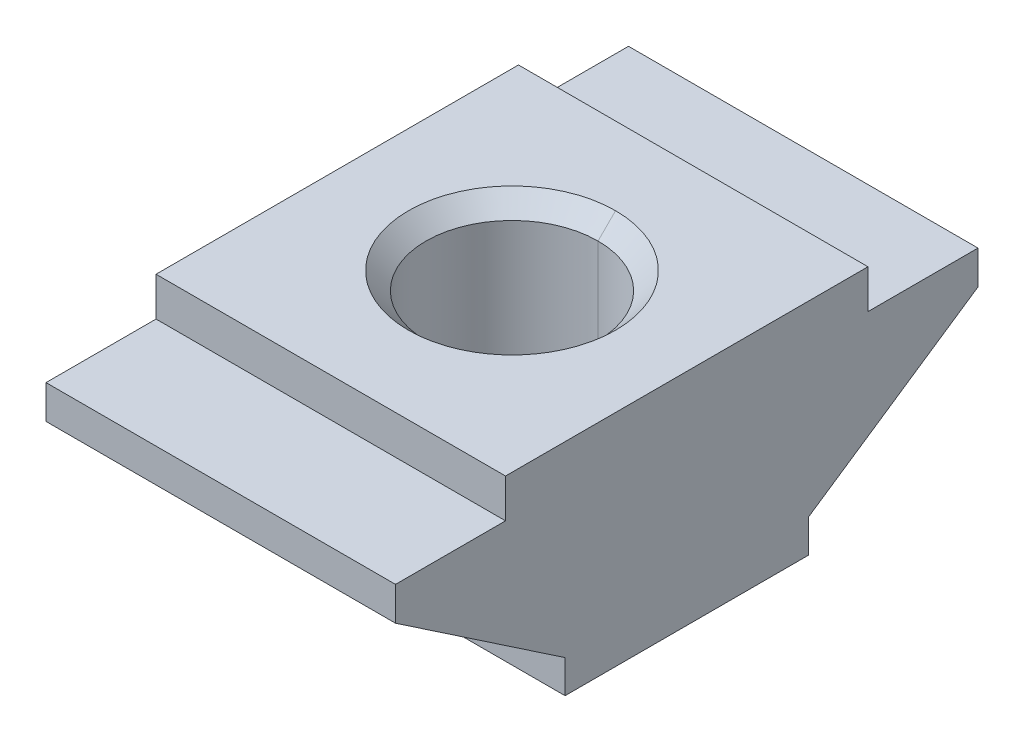
ISO-10303-21;
HEADER;
FILE_DESCRIPTION(('STEP AP214'),'2;1');
FILE_NAME('part.step','',(''),(''),'','','');
FILE_SCHEMA(('AUTOMOTIVE_DESIGN { 1 0 10303 214 1 1 1 1 }'));
ENDSEC;
DATA;
#1=APPLICATION_CONTEXT('core data for automotive mechanical design processes');
#2=APPLICATION_PROTOCOL_DEFINITION('international standard','automotive_design',2000,#1);
#3=PRODUCT_CONTEXT('',#1,'mechanical');
#4=PRODUCT('Part','Part','',(#3));
#5=PRODUCT_RELATED_PRODUCT_CATEGORY('part','',(#4));
#6=PRODUCT_DEFINITION_FORMATION('','',#4);
#7=PRODUCT_DEFINITION_CONTEXT('part definition',#1,'design');
#8=PRODUCT_DEFINITION('design','',#6,#7);
#9=PRODUCT_DEFINITION_SHAPE('','',#8);
#10=(LENGTH_UNIT() NAMED_UNIT(*) SI_UNIT(.MILLI.,.METRE.));
#11=(NAMED_UNIT(*) PLANE_ANGLE_UNIT() SI_UNIT($,.RADIAN.));
#12=(NAMED_UNIT(*) SI_UNIT($,.STERADIAN.) SOLID_ANGLE_UNIT());
#13=UNCERTAINTY_MEASURE_WITH_UNIT(LENGTH_MEASURE(1.E-05),#10,'distance_accuracy_value','');
#14=(GEOMETRIC_REPRESENTATION_CONTEXT(3) GLOBAL_UNCERTAINTY_ASSIGNED_CONTEXT((#13)) GLOBAL_UNIT_ASSIGNED_CONTEXT((#10,
#11,#12)) REPRESENTATION_CONTEXT('',''));
#15=CARTESIAN_POINT('',(0.,0.,0.));
#16=DIRECTION('',(0.,0.,1.));
#17=DIRECTION('',(1.,0.,0.));
#18=AXIS2_PLACEMENT_3D('',#15,#16,#17);
#19=CARTESIAN_POINT('',(6.75,7.,7.));
#20=DIRECTION('',(0.,-1.,0.));
#21=DIRECTION('',(0.,0.,-1.));
#22=AXIS2_PLACEMENT_3D('',#19,#20,#21);
#23=PLANE('',#22);
#24=DIRECTION('',(0.,0.,1.));
#25=VECTOR('',#24,1.);
#26=CARTESIAN_POINT('',(-6.75,7.,7.));
#27=LINE('',#26,#25);
#28=CARTESIAN_POINT('',(-6.75,7.,7.));
#29=VERTEX_POINT('',#28);
#30=CARTESIAN_POINT('',(-6.75,7.,11.25));
#31=VERTEX_POINT('',#30);
#32=EDGE_CURVE('E13',#29,#31,#27,.T.);
#33=ORIENTED_EDGE('',*,*,#32,.T.);
#34=DIRECTION('',(-1.,0.,0.));
#35=VECTOR('',#34,1.);
#36=CARTESIAN_POINT('',(6.75,7.,11.25));
#37=LINE('',#36,#35);
#38=CARTESIAN_POINT('',(6.75,7.,11.25));
#39=VERTEX_POINT('',#38);
#40=EDGE_CURVE('E32',#39,#31,#37,.T.);
#41=ORIENTED_EDGE('',*,*,#40,.F.);
#42=DIRECTION('',(0.,0.,1.));
#43=VECTOR('',#42,1.);
#44=CARTESIAN_POINT('',(6.75,7.,7.));
#45=LINE('',#44,#43);
#46=CARTESIAN_POINT('',(6.75,7.,7.));
#47=VERTEX_POINT('',#46);
#48=EDGE_CURVE('E364',#47,#39,#45,.T.);
#49=ORIENTED_EDGE('',*,*,#48,.F.);
#50=DIRECTION('',(-1.,0.,0.));
#51=VECTOR('',#50,1.);
#52=CARTESIAN_POINT('',(6.75,7.,7.));
#53=LINE('',#52,#51);
#54=EDGE_CURVE('E360',#47,#29,#53,.T.);
#55=ORIENTED_EDGE('',*,*,#54,.T.);
#56=EDGE_LOOP('',(#33,#41,#49,#55));
#57=FACE_BOUND('',#56,.T.);
#58=ADVANCED_FACE('F24',(#57),#23,.F.);
#59=CARTESIAN_POINT('',(6.75,8.5,7.));
#60=DIRECTION('',(0.,0.,-1.));
#61=DIRECTION('',(-1.,0.,0.));
#62=AXIS2_PLACEMENT_3D('',#59,#60,#61);
#63=PLANE('',#62);
#64=DIRECTION('',(0.,-1.,0.));
#65=VECTOR('',#64,1.);
#66=CARTESIAN_POINT('',(-6.75,8.5,7.));
#67=LINE('',#66,#65);
#68=CARTESIAN_POINT('',(-6.75,8.5,7.));
#69=VERTEX_POINT('',#68);
#70=EDGE_CURVE('E355',#69,#29,#67,.T.);
#71=ORIENTED_EDGE('',*,*,#70,.T.);
#72=ORIENTED_EDGE('',*,*,#54,.F.);
#73=DIRECTION('',(0.,-1.,0.));
#74=VECTOR('',#73,1.);
#75=CARTESIAN_POINT('',(6.75,8.5,7.));
#76=LINE('',#75,#74);
#77=CARTESIAN_POINT('',(6.75,8.5,7.));
#78=VERTEX_POINT('',#77);
#79=EDGE_CURVE('E350',#78,#47,#76,.T.);
#80=ORIENTED_EDGE('',*,*,#79,.F.);
#81=DIRECTION('',(-1.,0.,0.));
#82=VECTOR('',#81,1.);
#83=CARTESIAN_POINT('',(6.75,8.5,7.));
#84=LINE('',#83,#82);
#85=EDGE_CURVE('E346',#78,#69,#84,.T.);
#86=ORIENTED_EDGE('',*,*,#85,.T.);
#87=EDGE_LOOP('',(#71,#72,#80,#86));
#88=FACE_BOUND('',#87,.T.);
#89=ADVANCED_FACE('F390',(#88),#63,.F.);
#90=CARTESIAN_POINT('',(6.75,8.5,-7.));
#91=DIRECTION('',(0.,-1.,0.));
#92=DIRECTION('',(0.,0.,-1.));
#93=AXIS2_PLACEMENT_3D('',#90,#91,#92);
#94=PLANE('',#93);
#95=CARTESIAN_POINT('',(0.,8.5,0.));
#96=DIRECTION('',(0.,-1.,0.));
#97=DIRECTION('',(0.,0.,-1.));
#98=AXIS2_PLACEMENT_3D('',#95,#96,#97);
#99=CIRCLE('',#98,4.);
#100=CARTESIAN_POINT('',(0.,8.5,-4.));
#101=VERTEX_POINT('',#100);
#102=CARTESIAN_POINT('',(0.,8.5,4.));
#103=VERTEX_POINT('',#102);
#104=EDGE_CURVE('E161',#101,#103,#99,.T.);
#105=ORIENTED_EDGE('',*,*,#104,.T.);
#106=CARTESIAN_POINT('',(0.,8.5,0.));
#107=DIRECTION('',(0.,-1.,0.));
#108=DIRECTION('',(0.,0.,-1.));
#109=AXIS2_PLACEMENT_3D('',#106,#107,#108);
#110=CIRCLE('',#109,4.);
#111=EDGE_CURVE('E339',#103,#101,#110,.T.);
#112=ORIENTED_EDGE('',*,*,#111,.T.);
#113=EDGE_LOOP('',(#105,#112));
#114=FACE_BOUND('',#113,.T.);
#115=DIRECTION('',(0.,0.,1.));
#116=VECTOR('',#115,1.);
#117=CARTESIAN_POINT('',(-6.75,8.5,-7.));
#118=LINE('',#117,#116);
#119=CARTESIAN_POINT('',(-6.75,8.5,-7.));
#120=VERTEX_POINT('',#119);
#121=EDGE_CURVE('E334',#120,#69,#118,.T.);
#122=ORIENTED_EDGE('',*,*,#121,.T.);
#123=ORIENTED_EDGE('',*,*,#85,.F.);
#124=DIRECTION('',(0.,0.,1.));
#125=VECTOR('',#124,1.);
#126=CARTESIAN_POINT('',(6.75,8.5,-7.));
#127=LINE('',#126,#125);
#128=CARTESIAN_POINT('',(6.75,8.5,-7.));
#129=VERTEX_POINT('',#128);
#130=EDGE_CURVE('E329',#129,#78,#127,.T.);
#131=ORIENTED_EDGE('',*,*,#130,.F.);
#132=DIRECTION('',(-1.,0.,0.));
#133=VECTOR('',#132,1.);
#134=CARTESIAN_POINT('',(6.75,8.5,-7.));
#135=LINE('',#134,#133);
#136=EDGE_CURVE('E325',#129,#120,#135,.T.);
#137=ORIENTED_EDGE('',*,*,#136,.T.);
#138=EDGE_LOOP('',(#122,#123,#131,#137));
#139=FACE_BOUND('',#138,.T.);
#140=ADVANCED_FACE('F396',(#114,#139),#94,.F.);
#141=CARTESIAN_POINT('',(6.75,7.,-7.));
#142=DIRECTION('',(0.,0.,1.));
#143=DIRECTION('',(1.,0.,0.));
#144=AXIS2_PLACEMENT_3D('',#141,#142,#143);
#145=PLANE('',#144);
#146=DIRECTION('',(0.,1.,0.));
#147=VECTOR('',#146,1.);
#148=CARTESIAN_POINT('',(-6.75,7.,-7.));
#149=LINE('',#148,#147);
#150=CARTESIAN_POINT('',(-6.75,7.,-7.));
#151=VERTEX_POINT('',#150);
#152=EDGE_CURVE('E320',#151,#120,#149,.T.);
#153=ORIENTED_EDGE('',*,*,#152,.T.);
#154=ORIENTED_EDGE('',*,*,#136,.F.);
#155=DIRECTION('',(0.,1.,0.));
#156=VECTOR('',#155,1.);
#157=CARTESIAN_POINT('',(6.75,7.,-7.));
#158=LINE('',#157,#156);
#159=CARTESIAN_POINT('',(6.75,7.,-7.));
#160=VERTEX_POINT('',#159);
#161=EDGE_CURVE('E315',#160,#129,#158,.T.);
#162=ORIENTED_EDGE('',*,*,#161,.F.);
#163=DIRECTION('',(-1.,0.,0.));
#164=VECTOR('',#163,1.);
#165=CARTESIAN_POINT('',(6.75,7.,-7.));
#166=LINE('',#165,#164);
#167=EDGE_CURVE('E311',#160,#151,#166,.T.);
#168=ORIENTED_EDGE('',*,*,#167,.T.);
#169=EDGE_LOOP('',(#153,#154,#162,#168));
#170=FACE_BOUND('',#169,.T.);
#171=ADVANCED_FACE('F399',(#170),#145,.F.);
#172=CARTESIAN_POINT('',(6.75,7.,-11.25));
#173=DIRECTION('',(0.,-1.,0.));
#174=DIRECTION('',(0.,0.,-1.));
#175=AXIS2_PLACEMENT_3D('',#172,#173,#174);
#176=PLANE('',#175);
#177=DIRECTION('',(0.,0.,1.));
#178=VECTOR('',#177,1.);
#179=CARTESIAN_POINT('',(-6.75,7.,-11.25));
#180=LINE('',#179,#178);
#181=CARTESIAN_POINT('',(-6.75,7.,-11.25));
#182=VERTEX_POINT('',#181);
#183=EDGE_CURVE('E306',#182,#151,#180,.T.);
#184=ORIENTED_EDGE('',*,*,#183,.T.);
#185=ORIENTED_EDGE('',*,*,#167,.F.);
#186=DIRECTION('',(0.,0.,1.));
#187=VECTOR('',#186,1.);
#188=CARTESIAN_POINT('',(6.75,7.,-11.25));
#189=LINE('',#188,#187);
#190=CARTESIAN_POINT('',(6.75,7.,-11.25));
#191=VERTEX_POINT('',#190);
#192=EDGE_CURVE('E301',#191,#160,#189,.T.);
#193=ORIENTED_EDGE('',*,*,#192,.F.);
#194=DIRECTION('',(-1.,0.,0.));
#195=VECTOR('',#194,1.);
#196=CARTESIAN_POINT('',(6.75,7.,-11.25));
#197=LINE('',#196,#195);
#198=EDGE_CURVE('E297',#191,#182,#197,.T.);
#199=ORIENTED_EDGE('',*,*,#198,.T.);
#200=EDGE_LOOP('',(#184,#185,#193,#199));
#201=FACE_BOUND('',#200,.T.);
#202=ADVANCED_FACE('F402',(#201),#176,.F.);
#203=CARTESIAN_POINT('',(6.75,5.7,-11.25));
#204=DIRECTION('',(0.,0.,1.));
#205=DIRECTION('',(1.,0.,0.));
#206=AXIS2_PLACEMENT_3D('',#203,#204,#205);
#207=PLANE('',#206);
#208=DIRECTION('',(0.,1.,0.));
#209=VECTOR('',#208,1.);
#210=CARTESIAN_POINT('',(-6.75,5.7,-11.25));
#211=LINE('',#210,#209);
#212=CARTESIAN_POINT('',(-6.75,5.7,-11.25));
#213=VERTEX_POINT('',#212);
#214=EDGE_CURVE('E292',#213,#182,#211,.T.);
#215=ORIENTED_EDGE('',*,*,#214,.T.);
#216=ORIENTED_EDGE('',*,*,#198,.F.);
#217=DIRECTION('',(0.,1.,0.));
#218=VECTOR('',#217,1.);
#219=CARTESIAN_POINT('',(6.75,5.7,-11.25));
#220=LINE('',#219,#218);
#221=CARTESIAN_POINT('',(6.75,5.7,-11.25));
#222=VERTEX_POINT('',#221);
#223=EDGE_CURVE('E287',#222,#191,#220,.T.);
#224=ORIENTED_EDGE('',*,*,#223,.F.);
#225=DIRECTION('',(-1.,0.,0.));
#226=VECTOR('',#225,1.);
#227=CARTESIAN_POINT('',(6.75,5.7,-11.25));
#228=LINE('',#227,#226);
#229=EDGE_CURVE('E283',#222,#213,#228,.T.);
#230=ORIENTED_EDGE('',*,*,#229,.T.);
#231=EDGE_LOOP('',(#215,#216,#224,#230));
#232=FACE_BOUND('',#231,.T.);
#233=ADVANCED_FACE('F408',(#232),#207,.F.);
#234=CARTESIAN_POINT('',(6.75,1.275,-4.7));
#235=DIRECTION('',(0.,0.828628619379629,0.559798723779368));
#236=DIRECTION('',(0.,-0.559798723779368,0.828628619379629));
#237=AXIS2_PLACEMENT_3D('',#234,#235,#236);
#238=PLANE('',#237);
#239=DIRECTION('',(0.,0.559798723779368,-0.828628619379629));
#240=VECTOR('',#239,1.);
#241=CARTESIAN_POINT('',(-6.75,1.275,-4.7));
#242=LINE('',#241,#240);
#243=CARTESIAN_POINT('',(-6.75,1.275,-4.7));
#244=VERTEX_POINT('',#243);
#245=EDGE_CURVE('E278',#244,#213,#242,.T.);
#246=ORIENTED_EDGE('',*,*,#245,.T.);
#247=ORIENTED_EDGE('',*,*,#229,.F.);
#248=DIRECTION('',(0.,0.559798723779368,-0.828628619379629));
#249=VECTOR('',#248,1.);
#250=CARTESIAN_POINT('',(6.75,1.275,-4.7));
#251=LINE('',#250,#249);
#252=CARTESIAN_POINT('',(6.75,1.275,-4.7));
#253=VERTEX_POINT('',#252);
#254=EDGE_CURVE('E273',#253,#222,#251,.T.);
#255=ORIENTED_EDGE('',*,*,#254,.F.);
#256=DIRECTION('',(-1.,0.,0.));
#257=VECTOR('',#256,1.);
#258=CARTESIAN_POINT('',(6.75,1.275,-4.7));
#259=LINE('',#258,#257);
#260=EDGE_CURVE('E269',#253,#244,#259,.T.);
#261=ORIENTED_EDGE('',*,*,#260,.T.);
#262=EDGE_LOOP('',(#246,#247,#255,#261));
#263=FACE_BOUND('',#262,.T.);
#264=ADVANCED_FACE('F411',(#263),#238,.F.);
#265=CARTESIAN_POINT('',(6.75,0.,-4.7));
#266=DIRECTION('',(0.,0.,1.));
#267=DIRECTION('',(1.,0.,0.));
#268=AXIS2_PLACEMENT_3D('',#265,#266,#267);
#269=PLANE('',#268);
#270=DIRECTION('',(0.,1.,0.));
#271=VECTOR('',#270,1.);
#272=CARTESIAN_POINT('',(-6.75,0.,-4.7));
#273=LINE('',#272,#271);
#274=CARTESIAN_POINT('',(-6.75,0.,-4.7));
#275=VERTEX_POINT('',#274);
#276=EDGE_CURVE('E264',#275,#244,#273,.T.);
#277=ORIENTED_EDGE('',*,*,#276,.T.);
#278=ORIENTED_EDGE('',*,*,#260,.F.);
#279=DIRECTION('',(0.,1.,0.));
#280=VECTOR('',#279,1.);
#281=CARTESIAN_POINT('',(6.75,0.,-4.7));
#282=LINE('',#281,#280);
#283=CARTESIAN_POINT('',(6.75,0.,-4.7));
#284=VERTEX_POINT('',#283);
#285=EDGE_CURVE('E259',#284,#253,#282,.T.);
#286=ORIENTED_EDGE('',*,*,#285,.F.);
#287=DIRECTION('',(-1.,0.,0.));
#288=VECTOR('',#287,1.);
#289=CARTESIAN_POINT('',(6.75,0.,-4.7));
#290=LINE('',#289,#288);
#291=EDGE_CURVE('E255',#284,#275,#290,.T.);
#292=ORIENTED_EDGE('',*,*,#291,.T.);
#293=EDGE_LOOP('',(#277,#278,#286,#292));
#294=FACE_BOUND('',#293,.T.);
#295=ADVANCED_FACE('F414',(#294),#269,.F.);
#296=CARTESIAN_POINT('',(6.75,0.,4.7));
#297=DIRECTION('',(0.,1.,0.));
#298=DIRECTION('',(0.,0.,1.));
#299=AXIS2_PLACEMENT_3D('',#296,#297,#298);
#300=PLANE('',#299);
#301=CARTESIAN_POINT('',(0.,0.,0.));
#302=DIRECTION('',(0.,-1.,0.));
#303=DIRECTION('',(0.,0.,-1.));
#304=AXIS2_PLACEMENT_3D('',#301,#302,#303);
#305=CIRCLE('',#304,4.);
#306=CARTESIAN_POINT('',(0.,0.,-4.));
#307=VERTEX_POINT('',#306);
#308=CARTESIAN_POINT('',(0.,1.72684089250197E-12,4.00000000000173));
#309=VERTEX_POINT('',#308);
#310=EDGE_CURVE('E250',#307,#309,#305,.T.);
#311=ORIENTED_EDGE('',*,*,#310,.F.);
#312=CARTESIAN_POINT('',(0.,0.,0.));
#313=DIRECTION('',(0.,-1.,0.));
#314=DIRECTION('',(0.,0.,-1.));
#315=AXIS2_PLACEMENT_3D('',#312,#313,#314);
#316=CIRCLE('',#315,4.);
#317=EDGE_CURVE('E245',#309,#307,#316,.T.);
#318=ORIENTED_EDGE('',*,*,#317,.F.);
#319=EDGE_LOOP('',(#311,#318));
#320=FACE_BOUND('',#319,.T.);
#321=DIRECTION('',(0.,0.,-1.));
#322=VECTOR('',#321,1.);
#323=CARTESIAN_POINT('',(-6.75,0.,4.7));
#324=LINE('',#323,#322);
#325=CARTESIAN_POINT('',(-6.75,0.,4.7));
#326=VERTEX_POINT('',#325);
#327=EDGE_CURVE('E240',#326,#275,#324,.T.);
#328=ORIENTED_EDGE('',*,*,#327,.T.);
#329=ORIENTED_EDGE('',*,*,#291,.F.);
#330=DIRECTION('',(0.,0.,-1.));
#331=VECTOR('',#330,1.);
#332=CARTESIAN_POINT('',(6.75,0.,4.7));
#333=LINE('',#332,#331);
#334=CARTESIAN_POINT('',(6.75,0.,4.7));
#335=VERTEX_POINT('',#334);
#336=EDGE_CURVE('E235',#335,#284,#333,.T.);
#337=ORIENTED_EDGE('',*,*,#336,.F.);
#338=DIRECTION('',(-1.,0.,0.));
#339=VECTOR('',#338,1.);
#340=CARTESIAN_POINT('',(6.75,0.,4.7));
#341=LINE('',#340,#339);
#342=EDGE_CURVE('E231',#335,#326,#341,.T.);
#343=ORIENTED_EDGE('',*,*,#342,.T.);
#344=EDGE_LOOP('',(#328,#329,#337,#343));
#345=FACE_BOUND('',#344,.T.);
#346=ADVANCED_FACE('F417',(#320,#345),#300,.F.);
#347=CARTESIAN_POINT('',(6.75,1.275,4.7));
#348=DIRECTION('',(0.,0.,-1.));
#349=DIRECTION('',(-1.,0.,0.));
#350=AXIS2_PLACEMENT_3D('',#347,#348,#349);
#351=PLANE('',#350);
#352=DIRECTION('',(0.,-1.,0.));
#353=VECTOR('',#352,1.);
#354=CARTESIAN_POINT('',(-6.75,1.275,4.7));
#355=LINE('',#354,#353);
#356=CARTESIAN_POINT('',(-6.75,1.275,4.7));
#357=VERTEX_POINT('',#356);
#358=EDGE_CURVE('E226',#357,#326,#355,.T.);
#359=ORIENTED_EDGE('',*,*,#358,.T.);
#360=ORIENTED_EDGE('',*,*,#342,.F.);
#361=DIRECTION('',(0.,-1.,0.));
#362=VECTOR('',#361,1.);
#363=CARTESIAN_POINT('',(6.75,1.275,4.7));
#364=LINE('',#363,#362);
#365=CARTESIAN_POINT('',(6.75,1.275,4.7));
#366=VERTEX_POINT('',#365);
#367=EDGE_CURVE('E221',#366,#335,#364,.T.);
#368=ORIENTED_EDGE('',*,*,#367,.F.);
#369=DIRECTION('',(-1.,0.,0.));
#370=VECTOR('',#369,1.);
#371=CARTESIAN_POINT('',(6.75,1.275,4.7));
#372=LINE('',#371,#370);
#373=EDGE_CURVE('E217',#366,#357,#372,.T.);
#374=ORIENTED_EDGE('',*,*,#373,.T.);
#375=EDGE_LOOP('',(#359,#360,#368,#374));
#376=FACE_BOUND('',#375,.T.);
#377=ADVANCED_FACE('F420',(#376),#351,.F.);
#378=CARTESIAN_POINT('',(6.75,5.7,11.25));
#379=DIRECTION('',(0.,0.828628619379629,-0.559798723779368));
#380=DIRECTION('',(0.,0.559798723779368,0.828628619379629));
#381=AXIS2_PLACEMENT_3D('',#378,#379,#380);
#382=PLANE('',#381);
#383=DIRECTION('',(0.,-0.559798723779368,-0.828628619379629));
#384=VECTOR('',#383,1.);
#385=CARTESIAN_POINT('',(-6.75,5.7,11.25));
#386=LINE('',#385,#384);
#387=CARTESIAN_POINT('',(-6.75,5.7,11.25));
#388=VERTEX_POINT('',#387);
#389=EDGE_CURVE('E212',#388,#357,#386,.T.);
#390=ORIENTED_EDGE('',*,*,#389,.T.);
#391=ORIENTED_EDGE('',*,*,#373,.F.);
#392=DIRECTION('',(0.,-0.559798723779368,-0.828628619379629));
#393=VECTOR('',#392,1.);
#394=CARTESIAN_POINT('',(6.75,5.7,11.25));
#395=LINE('',#394,#393);
#396=CARTESIAN_POINT('',(6.75,5.7,11.25));
#397=VERTEX_POINT('',#396);
#398=EDGE_CURVE('E207',#397,#366,#395,.T.);
#399=ORIENTED_EDGE('',*,*,#398,.F.);
#400=DIRECTION('',(-1.,0.,0.));
#401=VECTOR('',#400,1.);
#402=CARTESIAN_POINT('',(6.75,5.7,11.25));
#403=LINE('',#402,#401);
#404=EDGE_CURVE('E203',#397,#388,#403,.T.);
#405=ORIENTED_EDGE('',*,*,#404,.T.);
#406=EDGE_LOOP('',(#390,#391,#399,#405));
#407=FACE_BOUND('',#406,.T.);
#408=ADVANCED_FACE('F385',(#407),#382,.F.);
#409=CARTESIAN_POINT('',(6.75,7.,11.25));
#410=DIRECTION('',(0.,0.,-1.));
#411=DIRECTION('',(-1.,0.,0.));
#412=AXIS2_PLACEMENT_3D('',#409,#410,#411);
#413=PLANE('',#412);
#414=DIRECTION('',(0.,-1.,0.));
#415=VECTOR('',#414,1.);
#416=CARTESIAN_POINT('',(-6.75,7.,11.25));
#417=LINE('',#416,#415);
#418=EDGE_CURVE('E198',#31,#388,#417,.T.);
#419=ORIENTED_EDGE('',*,*,#418,.T.);
#420=ORIENTED_EDGE('',*,*,#404,.F.);
#421=DIRECTION('',(0.,-1.,0.));
#422=VECTOR('',#421,1.);
#423=CARTESIAN_POINT('',(6.75,7.,11.25));
#424=LINE('',#423,#422);
#425=EDGE_CURVE('E193',#39,#397,#424,.T.);
#426=ORIENTED_EDGE('',*,*,#425,.F.);
#427=ORIENTED_EDGE('',*,*,#40,.T.);
#428=EDGE_LOOP('',(#419,#420,#426,#427));
#429=FACE_BOUND('',#428,.T.);
#430=ADVANCED_FACE('F375',(#429),#413,.F.);
#431=CARTESIAN_POINT('',(6.75,0.,0.));
#432=DIRECTION('',(1.,0.,0.));
#433=DIRECTION('',(0.,0.,-1.));
#434=AXIS2_PLACEMENT_3D('',#431,#432,#433);
#435=PLANE('',#434);
#436=ORIENTED_EDGE('',*,*,#425,.T.);
#437=ORIENTED_EDGE('',*,*,#398,.T.);
#438=ORIENTED_EDGE('',*,*,#367,.T.);
#439=ORIENTED_EDGE('',*,*,#336,.T.);
#440=ORIENTED_EDGE('',*,*,#285,.T.);
#441=ORIENTED_EDGE('',*,*,#254,.T.);
#442=ORIENTED_EDGE('',*,*,#223,.T.);
#443=ORIENTED_EDGE('',*,*,#192,.T.);
#444=ORIENTED_EDGE('',*,*,#161,.T.);
#445=ORIENTED_EDGE('',*,*,#130,.T.);
#446=ORIENTED_EDGE('',*,*,#79,.T.);
#447=ORIENTED_EDGE('',*,*,#48,.T.);
#448=EDGE_LOOP('',(#436,#437,#438,#439,#440,#441,#442,#443,#444,#445,#446,#447));
#449=FACE_BOUND('',#448,.T.);
#450=ADVANCED_FACE('F387',(#449),#435,.T.);
#451=CARTESIAN_POINT('',(-6.75,0.,0.));
#452=DIRECTION('',(1.,0.,0.));
#453=DIRECTION('',(0.,0.,-1.));
#454=AXIS2_PLACEMENT_3D('',#451,#452,#453);
#455=PLANE('',#454);
#456=ORIENTED_EDGE('',*,*,#418,.F.);
#457=ORIENTED_EDGE('',*,*,#32,.F.);
#458=ORIENTED_EDGE('',*,*,#70,.F.);
#459=ORIENTED_EDGE('',*,*,#121,.F.);
#460=ORIENTED_EDGE('',*,*,#152,.F.);
#461=ORIENTED_EDGE('',*,*,#183,.F.);
#462=ORIENTED_EDGE('',*,*,#214,.F.);
#463=ORIENTED_EDGE('',*,*,#245,.F.);
#464=ORIENTED_EDGE('',*,*,#276,.F.);
#465=ORIENTED_EDGE('',*,*,#327,.F.);
#466=ORIENTED_EDGE('',*,*,#358,.F.);
#467=ORIENTED_EDGE('',*,*,#389,.F.);
#468=EDGE_LOOP('',(#456,#457,#458,#459,#460,#461,#462,#463,#464,#465,#466,#467));
#469=FACE_BOUND('',#468,.T.);
#470=ADVANCED_FACE('F379',(#469),#455,.F.);
#471=CARTESIAN_POINT('',(0.,0.676500000000001,0.));
#472=DIRECTION('',(0.,-1.,0.));
#473=DIRECTION('',(1.,0.,0.));
#474=AXIS2_PLACEMENT_3D('',#471,#472,#473);
#475=CONICAL_SURFACE('',#474,3.3235,0.7853981634);
#476=CARTESIAN_POINT('',(0.,0.676500000000001,0.));
#477=DIRECTION('',(0.,-1.,0.));
#478=DIRECTION('',(0.,0.,-1.));
#479=AXIS2_PLACEMENT_3D('',#476,#477,#478);
#480=CIRCLE('',#479,3.3235);
#481=CARTESIAN_POINT('',(0.,0.676500000000001,3.3235));
#482=VERTEX_POINT('',#481);
#483=CARTESIAN_POINT('',(0.,0.676500000000001,-3.3235));
#484=VERTEX_POINT('',#483);
#485=EDGE_CURVE('E150',#482,#484,#480,.T.);
#486=ORIENTED_EDGE('',*,*,#485,.F.);
#487=DIRECTION('',(0.,-0.707106781184743,0.707106781188352));
#488=VECTOR('',#487,1.);
#489=CARTESIAN_POINT('',(0.,0.676500000000001,3.3235));
#490=LINE('',#489,#488);
#491=EDGE_CURVE('E185',#482,#309,#490,.T.);
#492=ORIENTED_EDGE('',*,*,#491,.T.);
#493=ORIENTED_EDGE('',*,*,#317,.T.);
#494=DIRECTION('',(0.,-0.707106781184743,-0.707106781188352));
#495=VECTOR('',#494,1.);
#496=CARTESIAN_POINT('',(0.,0.676500000000001,-3.3235));
#497=LINE('',#496,#495);
#498=EDGE_CURVE('E180',#484,#307,#497,.T.);
#499=ORIENTED_EDGE('',*,*,#498,.F.);
#500=EDGE_LOOP('',(#486,#492,#493,#499));
#501=FACE_BOUND('',#500,.T.);
#502=ADVANCED_FACE('F497',(#501),#475,.F.);
#503=CARTESIAN_POINT('',(0.,0.676500000000001,0.));
#504=DIRECTION('',(0.,-1.,0.));
#505=DIRECTION('',(-1.,0.,0.));
#506=AXIS2_PLACEMENT_3D('',#503,#504,#505);
#507=CONICAL_SURFACE('',#506,3.3235,0.7853981634);
#508=ORIENTED_EDGE('',*,*,#310,.T.);
#509=ORIENTED_EDGE('',*,*,#491,.F.);
#510=CARTESIAN_POINT('',(0.,0.676500000000001,0.));
#511=DIRECTION('',(0.,-1.,0.));
#512=DIRECTION('',(0.,0.,-1.));
#513=AXIS2_PLACEMENT_3D('',#510,#511,#512);
#514=CIRCLE('',#513,3.3235);
#515=EDGE_CURVE('E176',#484,#482,#514,.T.);
#516=ORIENTED_EDGE('',*,*,#515,.F.);
#517=ORIENTED_EDGE('',*,*,#498,.T.);
#518=EDGE_LOOP('',(#508,#509,#516,#517));
#519=FACE_BOUND('',#518,.T.);
#520=ADVANCED_FACE('F506',(#519),#507,.F.);
#521=CARTESIAN_POINT('',(0.,0.,0.));
#522=DIRECTION('',(0.,1.,0.));
#523=DIRECTION('',(-1.,0.,0.));
#524=AXIS2_PLACEMENT_3D('',#521,#522,#523);
#525=CYLINDRICAL_SURFACE('',#524,3.3235);
#526=ORIENTED_EDGE('',*,*,#515,.T.);
#527=DIRECTION('',(0.,1.,0.));
#528=VECTOR('',#527,1.);
#529=CARTESIAN_POINT('',(0.,0.6765,3.3235));
#530=LINE('',#529,#528);
#531=CARTESIAN_POINT('',(0.,7.8235,3.3235));
#532=VERTEX_POINT('',#531);
#533=EDGE_CURVE('E139',#482,#532,#530,.T.);
#534=ORIENTED_EDGE('',*,*,#533,.T.);
#535=CARTESIAN_POINT('',(0.,7.8235,0.));
#536=DIRECTION('',(0.,-1.,0.));
#537=DIRECTION('',(0.,0.,-1.));
#538=AXIS2_PLACEMENT_3D('',#535,#536,#537);
#539=CIRCLE('',#538,3.3235);
#540=CARTESIAN_POINT('',(0.,7.8235,-3.3235));
#541=VERTEX_POINT('',#540);
#542=EDGE_CURVE('E132',#541,#532,#539,.T.);
#543=ORIENTED_EDGE('',*,*,#542,.F.);
#544=DIRECTION('',(0.,1.,0.));
#545=VECTOR('',#544,1.);
#546=CARTESIAN_POINT('',(0.,0.6765,-3.3235));
#547=LINE('',#546,#545);
#548=EDGE_CURVE('E136',#484,#541,#547,.T.);
#549=ORIENTED_EDGE('',*,*,#548,.F.);
#550=EDGE_LOOP('',(#526,#534,#543,#549));
#551=FACE_BOUND('',#550,.T.);
#552=ADVANCED_FACE('F135',(#551),#525,.F.);
#553=CARTESIAN_POINT('',(0.,0.,0.));
#554=DIRECTION('',(0.,1.,0.));
#555=DIRECTION('',(1.,0.,0.));
#556=AXIS2_PLACEMENT_3D('',#553,#554,#555);
#557=CYLINDRICAL_SURFACE('',#556,3.3235);
#558=CARTESIAN_POINT('',(0.,7.8235,0.));
#559=DIRECTION('',(0.,-1.,0.));
#560=DIRECTION('',(0.,0.,-1.));
#561=AXIS2_PLACEMENT_3D('',#558,#559,#560);
#562=CIRCLE('',#561,3.3235);
#563=EDGE_CURVE('E148',#532,#541,#562,.T.);
#564=ORIENTED_EDGE('',*,*,#563,.F.);
#565=ORIENTED_EDGE('',*,*,#533,.F.);
#566=ORIENTED_EDGE('',*,*,#485,.T.);
#567=ORIENTED_EDGE('',*,*,#548,.T.);
#568=EDGE_LOOP('',(#564,#565,#566,#567));
#569=FACE_BOUND('',#568,.T.);
#570=ADVANCED_FACE('F147',(#569),#557,.F.);
#571=CARTESIAN_POINT('',(0.,8.5,0.));
#572=DIRECTION('',(0.,1.,0.));
#573=DIRECTION('',(1.,0.,0.));
#574=AXIS2_PLACEMENT_3D('',#571,#572,#573);
#575=CONICAL_SURFACE('',#574,4.,0.7853981634);
#576=ORIENTED_EDGE('',*,*,#111,.F.);
#577=DIRECTION('',(0.,0.707106781184743,0.707106781188352));
#578=VECTOR('',#577,1.);
#579=CARTESIAN_POINT('',(0.,7.82350000000173,3.32349999999827));
#580=LINE('',#579,#578);
#581=EDGE_CURVE('E158',#532,#103,#580,.T.);
#582=ORIENTED_EDGE('',*,*,#581,.F.);
#583=ORIENTED_EDGE('',*,*,#563,.T.);
#584=DIRECTION('',(0.,0.707106781184744,-0.707106781188351));
#585=VECTOR('',#584,1.);
#586=CARTESIAN_POINT('',(0.,7.82350000000173,-3.32349999999827));
#587=LINE('',#586,#585);
#588=EDGE_CURVE('E156',#541,#101,#587,.T.);
#589=ORIENTED_EDGE('',*,*,#588,.T.);
#590=EDGE_LOOP('',(#576,#582,#583,#589));
#591=FACE_BOUND('',#590,.T.);
#592=ADVANCED_FACE('F155',(#591),#575,.F.);
#593=CARTESIAN_POINT('',(0.,8.5,0.));
#594=DIRECTION('',(0.,1.,0.));
#595=DIRECTION('',(-1.,0.,0.));
#596=AXIS2_PLACEMENT_3D('',#593,#594,#595);
#597=CONICAL_SURFACE('',#596,4.,0.7853981634);
#598=ORIENTED_EDGE('',*,*,#542,.T.);
#599=ORIENTED_EDGE('',*,*,#581,.T.);
#600=ORIENTED_EDGE('',*,*,#104,.F.);
#601=ORIENTED_EDGE('',*,*,#588,.F.);
#602=EDGE_LOOP('',(#598,#599,#600,#601));
#603=FACE_BOUND('',#602,.T.);
#604=ADVANCED_FACE('F160',(#603),#597,.F.);
#605=CLOSED_SHELL('',(#58,#89,#140,#171,#202,#233,#264,#295,#346,#377,#408,#430,#450,#470,#502,
#520,#552,#570,#592,#604));
#606=MANIFOLD_SOLID_BREP('B1',#605);
#607=ADVANCED_BREP_SHAPE_REPRESENTATION('',(#18,#606),#14);
#608=SHAPE_DEFINITION_REPRESENTATION(#9,#607);
ENDSEC;
END-ISO-10303-21;
